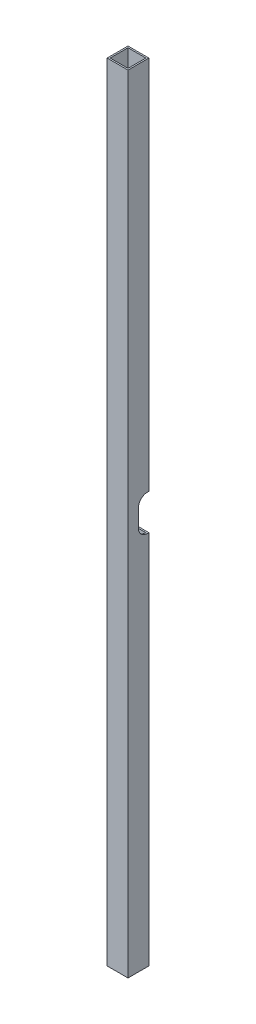
ISO-10303-21;
HEADER;
FILE_DESCRIPTION(('STEP AP214'),'2;1');
FILE_NAME('part.step','',(''),(''),'','','');
FILE_SCHEMA(('AUTOMOTIVE_DESIGN { 1 0 10303 214 1 1 1 1 }'));
ENDSEC;
DATA;
#1=APPLICATION_CONTEXT('core data for automotive mechanical design processes');
#2=APPLICATION_PROTOCOL_DEFINITION('international standard','automotive_design',2000,#1);
#3=PRODUCT_CONTEXT('',#1,'mechanical');
#4=PRODUCT('Part','Part','',(#3));
#5=PRODUCT_RELATED_PRODUCT_CATEGORY('part','',(#4));
#6=PRODUCT_DEFINITION_FORMATION('','',#4);
#7=PRODUCT_DEFINITION_CONTEXT('part definition',#1,'design');
#8=PRODUCT_DEFINITION('design','',#6,#7);
#9=PRODUCT_DEFINITION_SHAPE('','',#8);
#10=(LENGTH_UNIT() NAMED_UNIT(*) SI_UNIT(.MILLI.,.METRE.));
#11=(NAMED_UNIT(*) PLANE_ANGLE_UNIT() SI_UNIT($,.RADIAN.));
#12=(NAMED_UNIT(*) SI_UNIT($,.STERADIAN.) SOLID_ANGLE_UNIT());
#13=UNCERTAINTY_MEASURE_WITH_UNIT(LENGTH_MEASURE(1.E-05),#10,'distance_accuracy_value','');
#14=(GEOMETRIC_REPRESENTATION_CONTEXT(3) GLOBAL_UNCERTAINTY_ASSIGNED_CONTEXT((#13)) GLOBAL_UNIT_ASSIGNED_CONTEXT((#10,
#11,#12)) REPRESENTATION_CONTEXT('',''));
#15=CARTESIAN_POINT('',(0.,0.,0.));
#16=DIRECTION('',(0.,0.,1.));
#17=DIRECTION('',(1.,0.,0.));
#18=AXIS2_PLACEMENT_3D('',#15,#16,#17);
#19=CARTESIAN_POINT('',(657.225,-19.05,3.175));
#20=DIRECTION('',(1.,0.,0.));
#21=DIRECTION('',(0.,1.,0.));
#22=AXIS2_PLACEMENT_3D('',#19,#20,#21);
#23=CYLINDRICAL_SURFACE('',#22,19.05);
#24=DIRECTION('',(-1.,0.,0.));
#25=VECTOR('',#24,1.);
#26=CARTESIAN_POINT('',(657.225,-19.05,22.225));
#27=LINE('',#26,#25);
#28=CARTESIAN_POINT('',(704.85,-19.05,22.225));
#29=VERTEX_POINT('',#28);
#30=CARTESIAN_POINT('',(701.675,-19.05,22.225));
#31=VERTEX_POINT('',#30);
#32=EDGE_CURVE('E323',#29,#31,#27,.T.);
#33=ORIENTED_EDGE('',*,*,#32,.F.);
#34=CARTESIAN_POINT('',(704.85,-19.05,3.175));
#35=DIRECTION('',(1.,0.,0.));
#36=DIRECTION('',(0.,1.,0.));
#37=AXIS2_PLACEMENT_3D('',#34,#35,#36);
#38=CIRCLE('',#37,19.05);
#39=CARTESIAN_POINT('',(704.85,-38.1,3.175));
#40=VERTEX_POINT('',#39);
#41=EDGE_CURVE('E172',#40,#29,#38,.F.);
#42=ORIENTED_EDGE('',*,*,#41,.F.);
#43=DIRECTION('',(1.,0.,0.));
#44=VECTOR('',#43,1.);
#45=CARTESIAN_POINT('',(657.225,-38.1,3.175));
#46=LINE('',#45,#44);
#47=CARTESIAN_POINT('',(701.675,-38.1,3.175));
#48=VERTEX_POINT('',#47);
#49=EDGE_CURVE('E168',#48,#40,#46,.T.);
#50=ORIENTED_EDGE('',*,*,#49,.F.);
#51=CARTESIAN_POINT('',(701.675,-19.05,3.175));
#52=DIRECTION('',(1.,0.,0.));
#53=DIRECTION('',(0.,1.,0.));
#54=AXIS2_PLACEMENT_3D('',#51,#52,#53);
#55=CIRCLE('',#54,19.05);
#56=EDGE_CURVE('E19',#48,#31,#55,.F.);
#57=ORIENTED_EDGE('',*,*,#56,.T.);
#58=EDGE_LOOP('',(#33,#42,#50,#57));
#59=FACE_BOUND('',#58,.T.);
#60=ADVANCED_FACE('F16',(#59),#23,.F.);
#61=CARTESIAN_POINT('',(657.225,-2.9321578383444,22.225));
#62=DIRECTION('',(0.,0.,-1.));
#63=DIRECTION('',(-1.,0.,0.));
#64=AXIS2_PLACEMENT_3D('',#61,#62,#63);
#65=PLANE('',#64);
#66=DIRECTION('',(0.,1.,0.));
#67=VECTOR('',#66,1.);
#68=CARTESIAN_POINT('',(704.85,0.,22.225));
#69=LINE('',#68,#67);
#70=CARTESIAN_POINT('',(704.85,19.05,22.225));
#71=VERTEX_POINT('',#70);
#72=EDGE_CURVE('E250',#29,#71,#69,.T.);
#73=ORIENTED_EDGE('',*,*,#72,.F.);
#74=ORIENTED_EDGE('',*,*,#32,.T.);
#75=DIRECTION('',(0.,1.,0.));
#76=VECTOR('',#75,1.);
#77=CARTESIAN_POINT('',(701.675,0.,22.225));
#78=LINE('',#77,#76);
#79=CARTESIAN_POINT('',(701.675,19.05,22.225));
#80=VERTEX_POINT('',#79);
#81=EDGE_CURVE('E188',#31,#80,#78,.T.);
#82=ORIENTED_EDGE('',*,*,#81,.T.);
#83=DIRECTION('',(-1.,0.,0.));
#84=VECTOR('',#83,1.);
#85=CARTESIAN_POINT('',(657.225,19.05,22.225));
#86=LINE('',#85,#84);
#87=EDGE_CURVE('E179',#80,#71,#86,.F.);
#88=ORIENTED_EDGE('',*,*,#87,.T.);
#89=EDGE_LOOP('',(#73,#74,#82,#88));
#90=FACE_BOUND('',#89,.T.);
#91=ADVANCED_FACE('F471',(#90),#65,.T.);
#92=CARTESIAN_POINT('',(657.225,19.05,3.175));
#93=DIRECTION('',(-1.,0.,0.));
#94=DIRECTION('',(0.,-1.,0.));
#95=AXIS2_PLACEMENT_3D('',#92,#93,#94);
#96=CYLINDRICAL_SURFACE('',#95,19.05);
#97=DIRECTION('',(1.,0.,0.));
#98=VECTOR('',#97,1.);
#99=CARTESIAN_POINT('',(657.225,38.1,3.175));
#100=LINE('',#99,#98);
#101=CARTESIAN_POINT('',(701.675,38.1,3.175));
#102=VERTEX_POINT('',#101);
#103=CARTESIAN_POINT('',(704.85,38.1,3.175));
#104=VERTEX_POINT('',#103);
#105=EDGE_CURVE('E234',#102,#104,#100,.T.);
#106=ORIENTED_EDGE('',*,*,#105,.T.);
#107=CARTESIAN_POINT('',(704.85,19.05,3.175));
#108=DIRECTION('',(-1.,0.,0.));
#109=DIRECTION('',(0.,-1.,0.));
#110=AXIS2_PLACEMENT_3D('',#107,#108,#109);
#111=CIRCLE('',#110,19.05);
#112=EDGE_CURVE('E245',#71,#104,#111,.T.);
#113=ORIENTED_EDGE('',*,*,#112,.F.);
#114=ORIENTED_EDGE('',*,*,#87,.F.);
#115=CARTESIAN_POINT('',(701.675,19.05,3.175));
#116=DIRECTION('',(-1.,0.,0.));
#117=DIRECTION('',(0.,-1.,0.));
#118=AXIS2_PLACEMENT_3D('',#115,#116,#117);
#119=CIRCLE('',#118,19.05);
#120=EDGE_CURVE('E211',#80,#102,#119,.T.);
#121=ORIENTED_EDGE('',*,*,#120,.T.);
#122=EDGE_LOOP('',(#106,#113,#114,#121));
#123=FACE_BOUND('',#122,.T.);
#124=ADVANCED_FACE('F462',(#123),#96,.F.);
#125=CARTESIAN_POINT('',(352.425,0.,3.175));
#126=DIRECTION('',(0.,0.,1.));
#127=DIRECTION('',(1.,0.,0.));
#128=AXIS2_PLACEMENT_3D('',#125,#126,#127);
#129=PLANE('',#128);
#130=DIRECTION('',(1.,0.,0.));
#131=VECTOR('',#130,1.);
#132=CARTESIAN_POINT('',(682.625,838.2,3.175));
#133=LINE('',#132,#131);
#134=CARTESIAN_POINT('',(701.675,838.2,3.175));
#135=VERTEX_POINT('',#134);
#136=CARTESIAN_POINT('',(663.575,838.2,3.175));
#137=VERTEX_POINT('',#136);
#138=EDGE_CURVE('E227',#135,#137,#133,.F.);
#139=ORIENTED_EDGE('',*,*,#138,.T.);
#140=DIRECTION('',(0.,1.,0.));
#141=VECTOR('',#140,1.);
#142=CARTESIAN_POINT('',(663.575,0.,3.175));
#143=LINE('',#142,#141);
#144=CARTESIAN_POINT('',(663.575,38.1,3.175));
#145=VERTEX_POINT('',#144);
#146=EDGE_CURVE('E263',#145,#137,#143,.T.);
#147=ORIENTED_EDGE('',*,*,#146,.F.);
#148=DIRECTION('',(1.,0.,0.));
#149=VECTOR('',#148,1.);
#150=CARTESIAN_POINT('',(657.225,38.1,3.175));
#151=LINE('',#150,#149);
#152=EDGE_CURVE('E231',#145,#102,#151,.T.);
#153=ORIENTED_EDGE('',*,*,#152,.T.);
#154=DIRECTION('',(0.,1.,0.));
#155=VECTOR('',#154,1.);
#156=CARTESIAN_POINT('',(701.675,0.,3.175));
#157=LINE('',#156,#155);
#158=EDGE_CURVE('E205',#102,#135,#157,.T.);
#159=ORIENTED_EDGE('',*,*,#158,.T.);
#160=EDGE_LOOP('',(#139,#147,#153,#159));
#161=FACE_BOUND('',#160,.T.);
#162=ADVANCED_FACE('F460',(#161),#129,.T.);
#163=CARTESIAN_POINT('',(657.225,-38.1,10.495868107313));
#164=DIRECTION('',(0.,1.,0.));
#165=DIRECTION('',(0.,0.,1.));
#166=AXIS2_PLACEMENT_3D('',#163,#164,#165);
#167=PLANE('',#166);
#168=DIRECTION('',(0.,0.,1.));
#169=VECTOR('',#168,1.);
#170=CARTESIAN_POINT('',(660.4,-38.1,44.45));
#171=LINE('',#170,#169);
#172=CARTESIAN_POINT('',(660.4,-38.1,0.));
#173=VERTEX_POINT('',#172);
#174=CARTESIAN_POINT('',(660.4,-38.1,3.175));
#175=VERTEX_POINT('',#174);
#176=EDGE_CURVE('E244',#173,#175,#171,.T.);
#177=ORIENTED_EDGE('',*,*,#176,.T.);
#178=DIRECTION('',(1.,0.,0.));
#179=VECTOR('',#178,1.);
#180=CARTESIAN_POINT('',(657.225,-38.1,3.175));
#181=LINE('',#180,#179);
#182=CARTESIAN_POINT('',(663.575,-38.1,3.175));
#183=VERTEX_POINT('',#182);
#184=EDGE_CURVE('E178',#175,#183,#181,.T.);
#185=ORIENTED_EDGE('',*,*,#184,.T.);
#186=DIRECTION('',(1.,0.,0.));
#187=VECTOR('',#186,1.);
#188=CARTESIAN_POINT('',(352.425,-38.1,3.175));
#189=LINE('',#188,#187);
#190=EDGE_CURVE('E192',#48,#183,#189,.F.);
#191=ORIENTED_EDGE('',*,*,#190,.F.);
#192=ORIENTED_EDGE('',*,*,#49,.T.);
#193=DIRECTION('',(0.,0.,1.));
#194=VECTOR('',#193,1.);
#195=CARTESIAN_POINT('',(704.85,-38.1,44.45));
#196=LINE('',#195,#194);
#197=CARTESIAN_POINT('',(704.85,-38.1,0.));
#198=VERTEX_POINT('',#197);
#199=EDGE_CURVE('E253',#198,#40,#196,.T.);
#200=ORIENTED_EDGE('',*,*,#199,.F.);
#201=DIRECTION('',(1.,0.,0.));
#202=VECTOR('',#201,1.);
#203=CARTESIAN_POINT('',(352.425,-38.1,0.));
#204=LINE('',#203,#202);
#205=EDGE_CURVE('E190',#198,#173,#204,.F.);
#206=ORIENTED_EDGE('',*,*,#205,.T.);
#207=EDGE_LOOP('',(#177,#185,#191,#192,#200,#206));
#208=FACE_BOUND('',#207,.T.);
#209=ADVANCED_FACE('F193',(#208),#167,.T.);
#210=CARTESIAN_POINT('',(657.225,-19.05,3.175));
#211=DIRECTION('',(1.,0.,0.));
#212=DIRECTION('',(0.,1.,0.));
#213=AXIS2_PLACEMENT_3D('',#210,#211,#212);
#214=CYLINDRICAL_SURFACE('',#213,19.05);
#215=DIRECTION('',(-1.,0.,0.));
#216=VECTOR('',#215,1.);
#217=CARTESIAN_POINT('',(657.225,-19.05,22.225));
#218=LINE('',#217,#216);
#219=CARTESIAN_POINT('',(663.575,-19.05,22.225));
#220=VERTEX_POINT('',#219);
#221=CARTESIAN_POINT('',(660.4,-19.05,22.225));
#222=VERTEX_POINT('',#221);
#223=EDGE_CURVE('E295',#220,#222,#218,.T.);
#224=ORIENTED_EDGE('',*,*,#223,.F.);
#225=CARTESIAN_POINT('',(663.575,-19.05,3.175));
#226=DIRECTION('',(1.,0.,0.));
#227=DIRECTION('',(0.,1.,0.));
#228=AXIS2_PLACEMENT_3D('',#225,#226,#227);
#229=CIRCLE('',#228,19.05);
#230=EDGE_CURVE('E254',#183,#220,#229,.F.);
#231=ORIENTED_EDGE('',*,*,#230,.F.);
#232=ORIENTED_EDGE('',*,*,#184,.F.);
#233=CARTESIAN_POINT('',(660.4,-19.05,3.175));
#234=DIRECTION('',(1.,0.,0.));
#235=DIRECTION('',(0.,1.,0.));
#236=AXIS2_PLACEMENT_3D('',#233,#234,#235);
#237=CIRCLE('',#236,19.05);
#238=EDGE_CURVE('E241',#175,#222,#237,.F.);
#239=ORIENTED_EDGE('',*,*,#238,.T.);
#240=EDGE_LOOP('',(#224,#231,#232,#239));
#241=FACE_BOUND('',#240,.T.);
#242=ADVANCED_FACE('F469',(#241),#214,.F.);
#243=CARTESIAN_POINT('',(657.225,-2.9321578383444,22.225));
#244=DIRECTION('',(0.,0.,-1.));
#245=DIRECTION('',(-1.,0.,0.));
#246=AXIS2_PLACEMENT_3D('',#243,#244,#245);
#247=PLANE('',#246);
#248=DIRECTION('',(0.,1.,0.));
#249=VECTOR('',#248,1.);
#250=CARTESIAN_POINT('',(663.575,0.,22.225));
#251=LINE('',#250,#249);
#252=CARTESIAN_POINT('',(663.575,19.05,22.225));
#253=VERTEX_POINT('',#252);
#254=EDGE_CURVE('E198',#220,#253,#251,.T.);
#255=ORIENTED_EDGE('',*,*,#254,.F.);
#256=ORIENTED_EDGE('',*,*,#223,.T.);
#257=DIRECTION('',(0.,1.,0.));
#258=VECTOR('',#257,1.);
#259=CARTESIAN_POINT('',(660.4,0.,22.225));
#260=LINE('',#259,#258);
#261=CARTESIAN_POINT('',(660.4,19.05,22.225));
#262=VERTEX_POINT('',#261);
#263=EDGE_CURVE('E240',#222,#262,#260,.T.);
#264=ORIENTED_EDGE('',*,*,#263,.T.);
#265=DIRECTION('',(-1.,0.,0.));
#266=VECTOR('',#265,1.);
#267=CARTESIAN_POINT('',(657.225,19.05,22.225));
#268=LINE('',#267,#266);
#269=EDGE_CURVE('E280',#262,#253,#268,.F.);
#270=ORIENTED_EDGE('',*,*,#269,.T.);
#271=EDGE_LOOP('',(#255,#256,#264,#270));
#272=FACE_BOUND('',#271,.T.);
#273=ADVANCED_FACE('F403',(#272),#247,.T.);
#274=CARTESIAN_POINT('',(657.225,19.05,3.175));
#275=DIRECTION('',(-1.,0.,0.));
#276=DIRECTION('',(0.,-1.,0.));
#277=AXIS2_PLACEMENT_3D('',#274,#275,#276);
#278=CYLINDRICAL_SURFACE('',#277,19.05);
#279=DIRECTION('',(1.,0.,0.));
#280=VECTOR('',#279,1.);
#281=CARTESIAN_POINT('',(657.225,38.1,3.175));
#282=LINE('',#281,#280);
#283=CARTESIAN_POINT('',(660.4,38.1,3.175));
#284=VERTEX_POINT('',#283);
#285=EDGE_CURVE('E235',#284,#145,#282,.T.);
#286=ORIENTED_EDGE('',*,*,#285,.T.);
#287=CARTESIAN_POINT('',(663.575,19.05,3.175));
#288=DIRECTION('',(-1.,0.,0.));
#289=DIRECTION('',(0.,-1.,0.));
#290=AXIS2_PLACEMENT_3D('',#287,#288,#289);
#291=CIRCLE('',#290,19.05);
#292=EDGE_CURVE('E260',#253,#145,#291,.T.);
#293=ORIENTED_EDGE('',*,*,#292,.F.);
#294=ORIENTED_EDGE('',*,*,#269,.F.);
#295=CARTESIAN_POINT('',(660.4,19.05,3.175));
#296=DIRECTION('',(-1.,0.,0.));
#297=DIRECTION('',(0.,-1.,0.));
#298=AXIS2_PLACEMENT_3D('',#295,#296,#297);
#299=CIRCLE('',#298,19.05);
#300=EDGE_CURVE('E236',#262,#284,#299,.T.);
#301=ORIENTED_EDGE('',*,*,#300,.T.);
#302=EDGE_LOOP('',(#286,#293,#294,#301));
#303=FACE_BOUND('',#302,.T.);
#304=ADVANCED_FACE('F408',(#303),#278,.F.);
#305=CARTESIAN_POINT('',(657.225,38.1,10.4958681073129));
#306=DIRECTION('',(0.,1.,0.));
#307=DIRECTION('',(0.,0.,1.));
#308=AXIS2_PLACEMENT_3D('',#305,#306,#307);
#309=PLANE('',#308);
#310=ORIENTED_EDGE('',*,*,#105,.F.);
#311=ORIENTED_EDGE('',*,*,#152,.F.);
#312=ORIENTED_EDGE('',*,*,#285,.F.);
#313=DIRECTION('',(0.,0.,1.));
#314=VECTOR('',#313,1.);
#315=CARTESIAN_POINT('',(660.4,38.1,44.45));
#316=LINE('',#315,#314);
#317=CARTESIAN_POINT('',(660.4,38.1,0.));
#318=VERTEX_POINT('',#317);
#319=EDGE_CURVE('E239',#284,#318,#316,.F.);
#320=ORIENTED_EDGE('',*,*,#319,.T.);
#321=DIRECTION('',(1.,0.,0.));
#322=VECTOR('',#321,1.);
#323=CARTESIAN_POINT('',(352.425,38.1,0.));
#324=LINE('',#323,#322);
#325=CARTESIAN_POINT('',(704.85,38.1,0.));
#326=VERTEX_POINT('',#325);
#327=EDGE_CURVE('E281',#318,#326,#324,.T.);
#328=ORIENTED_EDGE('',*,*,#327,.T.);
#329=DIRECTION('',(0.,0.,1.));
#330=VECTOR('',#329,1.);
#331=CARTESIAN_POINT('',(704.85,38.1,44.45));
#332=LINE('',#331,#330);
#333=EDGE_CURVE('E340',#104,#326,#332,.F.);
#334=ORIENTED_EDGE('',*,*,#333,.F.);
#335=EDGE_LOOP('',(#310,#311,#312,#320,#328,#334));
#336=FACE_BOUND('',#335,.T.);
#337=ADVANCED_FACE('F413',(#336),#309,.F.);
#338=CARTESIAN_POINT('',(352.425,0.,0.));
#339=DIRECTION('',(0.,0.,1.));
#340=DIRECTION('',(1.,0.,0.));
#341=AXIS2_PLACEMENT_3D('',#338,#339,#340);
#342=PLANE('',#341);
#343=DIRECTION('',(0.,1.,0.));
#344=VECTOR('',#343,1.);
#345=CARTESIAN_POINT('',(660.4,0.,0.));
#346=LINE('',#345,#344);
#347=CARTESIAN_POINT('',(660.4,838.2,0.));
#348=VERTEX_POINT('',#347);
#349=EDGE_CURVE('E286',#318,#348,#346,.T.);
#350=ORIENTED_EDGE('',*,*,#349,.T.);
#351=DIRECTION('',(1.,0.,0.));
#352=VECTOR('',#351,1.);
#353=CARTESIAN_POINT('',(682.625,838.2,0.));
#354=LINE('',#353,#352);
#355=CARTESIAN_POINT('',(704.85,838.2,0.));
#356=VERTEX_POINT('',#355);
#357=EDGE_CURVE('E358',#348,#356,#354,.T.);
#358=ORIENTED_EDGE('',*,*,#357,.T.);
#359=DIRECTION('',(0.,1.,0.));
#360=VECTOR('',#359,1.);
#361=CARTESIAN_POINT('',(704.85,0.,0.));
#362=LINE('',#361,#360);
#363=EDGE_CURVE('E329',#326,#356,#362,.T.);
#364=ORIENTED_EDGE('',*,*,#363,.F.);
#365=ORIENTED_EDGE('',*,*,#327,.F.);
#366=EDGE_LOOP('',(#350,#358,#364,#365));
#367=FACE_BOUND('',#366,.T.);
#368=ADVANCED_FACE('F499',(#367),#342,.F.);
#369=CARTESIAN_POINT('',(352.425,0.,0.));
#370=DIRECTION('',(0.,0.,1.));
#371=DIRECTION('',(1.,0.,0.));
#372=AXIS2_PLACEMENT_3D('',#369,#370,#371);
#373=PLANE('',#372);
#374=ORIENTED_EDGE('',*,*,#205,.F.);
#375=DIRECTION('',(0.,1.,0.));
#376=VECTOR('',#375,1.);
#377=CARTESIAN_POINT('',(704.85,0.,0.));
#378=LINE('',#377,#376);
#379=CARTESIAN_POINT('',(704.85,-838.2,0.));
#380=VERTEX_POINT('',#379);
#381=EDGE_CURVE('E326',#380,#198,#378,.T.);
#382=ORIENTED_EDGE('',*,*,#381,.F.);
#383=DIRECTION('',(1.,0.,0.));
#384=VECTOR('',#383,1.);
#385=CARTESIAN_POINT('',(682.625,-838.2,0.));
#386=LINE('',#385,#384);
#387=CARTESIAN_POINT('',(660.4,-838.2,0.));
#388=VERTEX_POINT('',#387);
#389=EDGE_CURVE('E290',#388,#380,#386,.T.);
#390=ORIENTED_EDGE('',*,*,#389,.F.);
#391=DIRECTION('',(0.,1.,0.));
#392=VECTOR('',#391,1.);
#393=CARTESIAN_POINT('',(660.4,0.,0.));
#394=LINE('',#393,#392);
#395=EDGE_CURVE('E301',#388,#173,#394,.T.);
#396=ORIENTED_EDGE('',*,*,#395,.T.);
#397=EDGE_LOOP('',(#374,#382,#390,#396));
#398=FACE_BOUND('',#397,.T.);
#399=ADVANCED_FACE('F496',(#398),#373,.F.);
#400=CARTESIAN_POINT('',(701.675,0.,44.45));
#401=DIRECTION('',(1.,0.,0.));
#402=DIRECTION('',(0.,1.,0.));
#403=AXIS2_PLACEMENT_3D('',#400,#401,#402);
#404=PLANE('',#403);
#405=ORIENTED_EDGE('',*,*,#120,.F.);
#406=ORIENTED_EDGE('',*,*,#81,.F.);
#407=ORIENTED_EDGE('',*,*,#56,.F.);
#408=DIRECTION('',(0.,1.,0.));
#409=VECTOR('',#408,1.);
#410=CARTESIAN_POINT('',(701.675,0.,3.175));
#411=LINE('',#410,#409);
#412=CARTESIAN_POINT('',(701.675,-838.2,3.175));
#413=VERTEX_POINT('',#412);
#414=EDGE_CURVE('E186',#413,#48,#411,.T.);
#415=ORIENTED_EDGE('',*,*,#414,.F.);
#416=DIRECTION('',(0.,0.,-1.));
#417=VECTOR('',#416,1.);
#418=CARTESIAN_POINT('',(701.675,-838.2,44.45));
#419=LINE('',#418,#417);
#420=CARTESIAN_POINT('',(701.675,-838.2,41.275));
#421=VERTEX_POINT('',#420);
#422=EDGE_CURVE('E219',#421,#413,#419,.T.);
#423=ORIENTED_EDGE('',*,*,#422,.F.);
#424=DIRECTION('',(0.,1.,0.));
#425=VECTOR('',#424,1.);
#426=CARTESIAN_POINT('',(701.675,0.,41.275));
#427=LINE('',#426,#425);
#428=CARTESIAN_POINT('',(701.675,838.2,41.275));
#429=VERTEX_POINT('',#428);
#430=EDGE_CURVE('E381',#421,#429,#427,.T.);
#431=ORIENTED_EDGE('',*,*,#430,.T.);
#432=DIRECTION('',(0.,0.,-1.));
#433=VECTOR('',#432,1.);
#434=CARTESIAN_POINT('',(701.675,838.2,44.45));
#435=LINE('',#434,#433);
#436=EDGE_CURVE('E224',#429,#135,#435,.T.);
#437=ORIENTED_EDGE('',*,*,#436,.T.);
#438=ORIENTED_EDGE('',*,*,#158,.F.);
#439=EDGE_LOOP('',(#405,#406,#407,#415,#423,#431,#437,#438));
#440=FACE_BOUND('',#439,.T.);
#441=ADVANCED_FACE('F184',(#440),#404,.F.);
#442=CARTESIAN_POINT('',(352.425,0.,3.175));
#443=DIRECTION('',(0.,0.,1.));
#444=DIRECTION('',(1.,0.,0.));
#445=AXIS2_PLACEMENT_3D('',#442,#443,#444);
#446=PLANE('',#445);
#447=DIRECTION('',(0.,1.,0.));
#448=VECTOR('',#447,1.);
#449=CARTESIAN_POINT('',(663.575,0.,3.175));
#450=LINE('',#449,#448);
#451=CARTESIAN_POINT('',(663.575,-838.2,3.175));
#452=VERTEX_POINT('',#451);
#453=EDGE_CURVE('E259',#452,#183,#450,.T.);
#454=ORIENTED_EDGE('',*,*,#453,.F.);
#455=DIRECTION('',(1.,0.,0.));
#456=VECTOR('',#455,1.);
#457=CARTESIAN_POINT('',(682.625,-838.2,3.175));
#458=LINE('',#457,#456);
#459=EDGE_CURVE('E202',#413,#452,#458,.F.);
#460=ORIENTED_EDGE('',*,*,#459,.F.);
#461=ORIENTED_EDGE('',*,*,#414,.T.);
#462=ORIENTED_EDGE('',*,*,#190,.T.);
#463=EDGE_LOOP('',(#454,#460,#461,#462));
#464=FACE_BOUND('',#463,.T.);
#465=ADVANCED_FACE('F200',(#464),#446,.T.);
#466=CARTESIAN_POINT('',(663.575,0.,44.45));
#467=DIRECTION('',(1.,0.,0.));
#468=DIRECTION('',(0.,1.,0.));
#469=AXIS2_PLACEMENT_3D('',#466,#467,#468);
#470=PLANE('',#469);
#471=ORIENTED_EDGE('',*,*,#453,.T.);
#472=ORIENTED_EDGE('',*,*,#230,.T.);
#473=ORIENTED_EDGE('',*,*,#254,.T.);
#474=ORIENTED_EDGE('',*,*,#292,.T.);
#475=ORIENTED_EDGE('',*,*,#146,.T.);
#476=DIRECTION('',(0.,0.,-1.));
#477=VECTOR('',#476,1.);
#478=CARTESIAN_POINT('',(663.575,838.2,44.45));
#479=LINE('',#478,#477);
#480=CARTESIAN_POINT('',(663.575,838.2,41.275));
#481=VERTEX_POINT('',#480);
#482=EDGE_CURVE('E357',#137,#481,#479,.F.);
#483=ORIENTED_EDGE('',*,*,#482,.T.);
#484=DIRECTION('',(0.,1.,0.));
#485=VECTOR('',#484,1.);
#486=CARTESIAN_POINT('',(663.575,0.,41.275));
#487=LINE('',#486,#485);
#488=CARTESIAN_POINT('',(663.575,-838.2,41.275));
#489=VERTEX_POINT('',#488);
#490=EDGE_CURVE('E258',#481,#489,#487,.F.);
#491=ORIENTED_EDGE('',*,*,#490,.T.);
#492=DIRECTION('',(0.,0.,-1.));
#493=VECTOR('',#492,1.);
#494=CARTESIAN_POINT('',(663.575,-838.2,44.45));
#495=LINE('',#494,#493);
#496=EDGE_CURVE('E343',#452,#489,#495,.F.);
#497=ORIENTED_EDGE('',*,*,#496,.F.);
#498=EDGE_LOOP('',(#471,#472,#473,#474,#475,#483,#491,#497));
#499=FACE_BOUND('',#498,.T.);
#500=ADVANCED_FACE('F399',(#499),#470,.T.);
#501=CARTESIAN_POINT('',(352.425,0.,41.275));
#502=DIRECTION('',(0.,0.,1.));
#503=DIRECTION('',(1.,0.,0.));
#504=AXIS2_PLACEMENT_3D('',#501,#502,#503);
#505=PLANE('',#504);
#506=DIRECTION('',(1.,0.,0.));
#507=VECTOR('',#506,1.);
#508=CARTESIAN_POINT('',(682.625,-838.2,41.275));
#509=LINE('',#508,#507);
#510=EDGE_CURVE('E347',#489,#421,#509,.T.);
#511=ORIENTED_EDGE('',*,*,#510,.F.);
#512=ORIENTED_EDGE('',*,*,#490,.F.);
#513=DIRECTION('',(1.,0.,0.));
#514=VECTOR('',#513,1.);
#515=CARTESIAN_POINT('',(682.625,838.2,41.275));
#516=LINE('',#515,#514);
#517=EDGE_CURVE('E228',#481,#429,#516,.T.);
#518=ORIENTED_EDGE('',*,*,#517,.T.);
#519=ORIENTED_EDGE('',*,*,#430,.F.);
#520=EDGE_LOOP('',(#511,#512,#518,#519));
#521=FACE_BOUND('',#520,.T.);
#522=ADVANCED_FACE('F453',(#521),#505,.F.);
#523=CARTESIAN_POINT('',(704.85,0.,44.45));
#524=DIRECTION('',(1.,0.,0.));
#525=DIRECTION('',(0.,1.,0.));
#526=AXIS2_PLACEMENT_3D('',#523,#524,#525);
#527=PLANE('',#526);
#528=ORIENTED_EDGE('',*,*,#72,.T.);
#529=ORIENTED_EDGE('',*,*,#112,.T.);
#530=ORIENTED_EDGE('',*,*,#333,.T.);
#531=ORIENTED_EDGE('',*,*,#363,.T.);
#532=DIRECTION('',(0.,0.,-1.));
#533=VECTOR('',#532,1.);
#534=CARTESIAN_POINT('',(704.85,838.2,44.45));
#535=LINE('',#534,#533);
#536=CARTESIAN_POINT('',(704.85,838.2,44.45));
#537=VERTEX_POINT('',#536);
#538=EDGE_CURVE('E249',#356,#537,#535,.F.);
#539=ORIENTED_EDGE('',*,*,#538,.T.);
#540=DIRECTION('',(0.,1.,0.));
#541=VECTOR('',#540,1.);
#542=CARTESIAN_POINT('',(704.85,0.,44.45));
#543=LINE('',#542,#541);
#544=CARTESIAN_POINT('',(704.85,-838.2,44.45));
#545=VERTEX_POINT('',#544);
#546=EDGE_CURVE('E441',#545,#537,#543,.T.);
#547=ORIENTED_EDGE('',*,*,#546,.F.);
#548=DIRECTION('',(0.,0.,-1.));
#549=VECTOR('',#548,1.);
#550=CARTESIAN_POINT('',(704.85,-838.2,44.45));
#551=LINE('',#550,#549);
#552=EDGE_CURVE('E315',#380,#545,#551,.F.);
#553=ORIENTED_EDGE('',*,*,#552,.F.);
#554=ORIENTED_EDGE('',*,*,#381,.T.);
#555=ORIENTED_EDGE('',*,*,#199,.T.);
#556=ORIENTED_EDGE('',*,*,#41,.T.);
#557=EDGE_LOOP('',(#528,#529,#530,#531,#539,#547,#553,#554,#555,#556));
#558=FACE_BOUND('',#557,.T.);
#559=ADVANCED_FACE('F484',(#558),#527,.T.);
#560=CARTESIAN_POINT('',(682.625,838.2,44.45));
#561=DIRECTION('',(0.,-1.,0.));
#562=DIRECTION('',(0.,0.,-1.));
#563=AXIS2_PLACEMENT_3D('',#560,#561,#562);
#564=PLANE('',#563);
#565=ORIENTED_EDGE('',*,*,#436,.F.);
#566=ORIENTED_EDGE('',*,*,#517,.F.);
#567=ORIENTED_EDGE('',*,*,#482,.F.);
#568=ORIENTED_EDGE('',*,*,#138,.F.);
#569=EDGE_LOOP('',(#565,#566,#567,#568));
#570=FACE_BOUND('',#569,.T.);
#571=DIRECTION('',(0.,0.,1.));
#572=VECTOR('',#571,1.);
#573=CARTESIAN_POINT('',(660.4,838.2,44.45));
#574=LINE('',#573,#572);
#575=CARTESIAN_POINT('',(660.4,838.2,44.45));
#576=VERTEX_POINT('',#575);
#577=EDGE_CURVE('E305',#348,#576,#574,.T.);
#578=ORIENTED_EDGE('',*,*,#577,.T.);
#579=DIRECTION('',(1.,0.,0.));
#580=VECTOR('',#579,1.);
#581=CARTESIAN_POINT('',(352.425,838.2,44.45));
#582=LINE('',#581,#580);
#583=EDGE_CURVE('E434',#537,#576,#582,.F.);
#584=ORIENTED_EDGE('',*,*,#583,.F.);
#585=ORIENTED_EDGE('',*,*,#538,.F.);
#586=ORIENTED_EDGE('',*,*,#357,.F.);
#587=EDGE_LOOP('',(#578,#584,#585,#586));
#588=FACE_BOUND('',#587,.T.);
#589=ADVANCED_FACE('F432',(#570,#588),#564,.F.);
#590=CARTESIAN_POINT('',(660.4,0.,44.45));
#591=DIRECTION('',(1.,0.,0.));
#592=DIRECTION('',(0.,1.,0.));
#593=AXIS2_PLACEMENT_3D('',#590,#591,#592);
#594=PLANE('',#593);
#595=ORIENTED_EDGE('',*,*,#319,.F.);
#596=ORIENTED_EDGE('',*,*,#300,.F.);
#597=ORIENTED_EDGE('',*,*,#263,.F.);
#598=ORIENTED_EDGE('',*,*,#238,.F.);
#599=ORIENTED_EDGE('',*,*,#176,.F.);
#600=ORIENTED_EDGE('',*,*,#395,.F.);
#601=DIRECTION('',(0.,0.,-1.));
#602=VECTOR('',#601,1.);
#603=CARTESIAN_POINT('',(660.4,-838.2,44.45));
#604=LINE('',#603,#602);
#605=CARTESIAN_POINT('',(660.4,-838.2,44.45));
#606=VERTEX_POINT('',#605);
#607=EDGE_CURVE('E39',#606,#388,#604,.T.);
#608=ORIENTED_EDGE('',*,*,#607,.F.);
#609=DIRECTION('',(0.,1.,0.));
#610=VECTOR('',#609,1.);
#611=CARTESIAN_POINT('',(660.4,0.,44.45));
#612=LINE('',#611,#610);
#613=EDGE_CURVE('E26',#576,#606,#612,.F.);
#614=ORIENTED_EDGE('',*,*,#613,.F.);
#615=ORIENTED_EDGE('',*,*,#577,.F.);
#616=ORIENTED_EDGE('',*,*,#349,.F.);
#617=EDGE_LOOP('',(#595,#596,#597,#598,#599,#600,#608,#614,#615,#616));
#618=FACE_BOUND('',#617,.T.);
#619=ADVANCED_FACE('F416',(#618),#594,.F.);
#620=CARTESIAN_POINT('',(682.625,-838.2,44.45));
#621=DIRECTION('',(0.,-1.,0.));
#622=DIRECTION('',(0.,0.,-1.));
#623=AXIS2_PLACEMENT_3D('',#620,#621,#622);
#624=PLANE('',#623);
#625=ORIENTED_EDGE('',*,*,#496,.T.);
#626=ORIENTED_EDGE('',*,*,#510,.T.);
#627=ORIENTED_EDGE('',*,*,#422,.T.);
#628=ORIENTED_EDGE('',*,*,#459,.T.);
#629=EDGE_LOOP('',(#625,#626,#627,#628));
#630=FACE_BOUND('',#629,.T.);
#631=DIRECTION('',(1.,0.,0.));
#632=VECTOR('',#631,1.);
#633=CARTESIAN_POINT('',(352.425,-838.2,44.45));
#634=LINE('',#633,#632);
#635=EDGE_CURVE('E11',#606,#545,#634,.T.);
#636=ORIENTED_EDGE('',*,*,#635,.F.);
#637=ORIENTED_EDGE('',*,*,#607,.T.);
#638=ORIENTED_EDGE('',*,*,#389,.T.);
#639=ORIENTED_EDGE('',*,*,#552,.T.);
#640=EDGE_LOOP('',(#636,#637,#638,#639));
#641=FACE_BOUND('',#640,.T.);
#642=ADVANCED_FACE('F448',(#630,#641),#624,.T.);
#643=CARTESIAN_POINT('',(352.425,0.,44.45));
#644=DIRECTION('',(0.,0.,1.));
#645=DIRECTION('',(1.,0.,0.));
#646=AXIS2_PLACEMENT_3D('',#643,#644,#645);
#647=PLANE('',#646);
#648=ORIENTED_EDGE('',*,*,#613,.T.);
#649=ORIENTED_EDGE('',*,*,#635,.T.);
#650=ORIENTED_EDGE('',*,*,#546,.T.);
#651=ORIENTED_EDGE('',*,*,#583,.T.);
#652=EDGE_LOOP('',(#648,#649,#650,#651));
#653=FACE_BOUND('',#652,.T.);
#654=ADVANCED_FACE('F440',(#653),#647,.T.);
#655=CLOSED_SHELL('',(#60,#91,#124,#162,#209,#242,#273,#304,#337,#368,#399,#441,#465,#500,#522,
#559,#589,#619,#642,#654));
#656=MANIFOLD_SOLID_BREP('B1',#655);
#657=ADVANCED_BREP_SHAPE_REPRESENTATION('',(#18,#656),#14);
#658=SHAPE_DEFINITION_REPRESENTATION(#9,#657);
ENDSEC;
END-ISO-10303-21;
